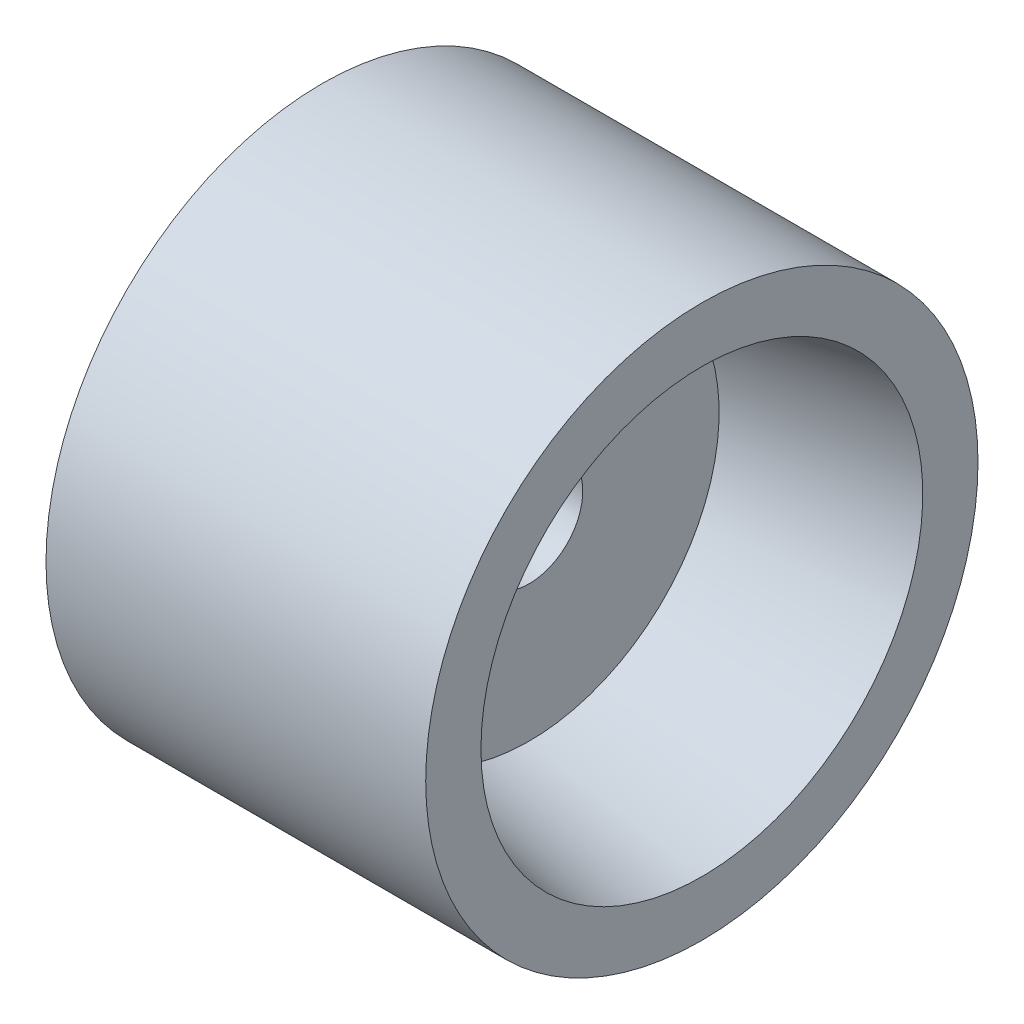
ISO-10303-21;
HEADER;
FILE_DESCRIPTION(('STEP AP214'),'2;1');
FILE_NAME('part.step','',(''),(''),'','','');
FILE_SCHEMA(('AUTOMOTIVE_DESIGN { 1 0 10303 214 1 1 1 1 }'));
ENDSEC;
DATA;
#1=APPLICATION_CONTEXT('core data for automotive mechanical design processes');
#2=APPLICATION_PROTOCOL_DEFINITION('international standard','automotive_design',2000,#1);
#3=PRODUCT_CONTEXT('',#1,'mechanical');
#4=PRODUCT('Part','Part','',(#3));
#5=PRODUCT_RELATED_PRODUCT_CATEGORY('part','',(#4));
#6=PRODUCT_DEFINITION_FORMATION('','',#4);
#7=PRODUCT_DEFINITION_CONTEXT('part definition',#1,'design');
#8=PRODUCT_DEFINITION('design','',#6,#7);
#9=PRODUCT_DEFINITION_SHAPE('','',#8);
#10=(LENGTH_UNIT() NAMED_UNIT(*) SI_UNIT(.MILLI.,.METRE.));
#11=(NAMED_UNIT(*) PLANE_ANGLE_UNIT() SI_UNIT($,.RADIAN.));
#12=(NAMED_UNIT(*) SI_UNIT($,.STERADIAN.) SOLID_ANGLE_UNIT());
#13=UNCERTAINTY_MEASURE_WITH_UNIT(LENGTH_MEASURE(1.E-05),#10,'distance_accuracy_value','');
#14=(GEOMETRIC_REPRESENTATION_CONTEXT(3) GLOBAL_UNCERTAINTY_ASSIGNED_CONTEXT((#13)) GLOBAL_UNIT_ASSIGNED_CONTEXT((#10,
#11,#12)) REPRESENTATION_CONTEXT('',''));
#15=CARTESIAN_POINT('',(0.,0.,0.));
#16=DIRECTION('',(0.,0.,1.));
#17=DIRECTION('',(1.,0.,0.));
#18=AXIS2_PLACEMENT_3D('',#15,#16,#17);
#19=CARTESIAN_POINT('',(11.,5.5,0.));
#20=DIRECTION('',(-1.,0.,0.));
#21=DIRECTION('',(0.,0.,1.));
#22=AXIS2_PLACEMENT_3D('',#19,#20,#21);
#23=PLANE('',#22);
#24=CARTESIAN_POINT('',(11.,0.,0.));
#25=DIRECTION('',(-1.,0.,0.));
#26=DIRECTION('',(0.,0.,1.));
#27=AXIS2_PLACEMENT_3D('',#24,#25,#26);
#28=CIRCLE('',#27,5.5);
#29=CARTESIAN_POINT('',(11.,0.,5.5));
#30=VERTEX_POINT('',#29);
#31=EDGE_CURVE('E80',#30,#30,#28,.T.);
#32=ORIENTED_EDGE('',*,*,#31,.F.);
#33=EDGE_LOOP('',(#32));
#34=FACE_BOUND('',#33,.T.);
#35=CARTESIAN_POINT('',(11.,0.,0.));
#36=DIRECTION('',(-1.,0.,0.));
#37=DIRECTION('',(0.,0.,1.));
#38=AXIS2_PLACEMENT_3D('',#35,#36,#37);
#39=CIRCLE('',#38,1.55);
#40=CARTESIAN_POINT('',(11.,0.,1.55));
#41=VERTEX_POINT('',#40);
#42=EDGE_CURVE('E10',#41,#41,#39,.T.);
#43=ORIENTED_EDGE('',*,*,#42,.T.);
#44=EDGE_LOOP('',(#43));
#45=FACE_BOUND('',#44,.T.);
#46=ADVANCED_FACE('F37',(#34,#45),#23,.F.);
#47=CARTESIAN_POINT('',(0.,0.,0.));
#48=DIRECTION('',(-1.,0.,0.));
#49=DIRECTION('',(0.,0.,1.));
#50=AXIS2_PLACEMENT_3D('',#47,#48,#49);
#51=CYLINDRICAL_SURFACE('',#50,1.55);
#52=ORIENTED_EDGE('',*,*,#42,.F.);
#53=EDGE_LOOP('',(#52));
#54=FACE_BOUND('',#53,.T.);
#55=CARTESIAN_POINT('',(8.,0.,0.));
#56=DIRECTION('',(-1.,0.,0.));
#57=DIRECTION('',(0.,0.,1.));
#58=AXIS2_PLACEMENT_3D('',#55,#56,#57);
#59=CIRCLE('',#58,1.55);
#60=CARTESIAN_POINT('',(8.,0.,1.55));
#61=VERTEX_POINT('',#60);
#62=EDGE_CURVE('E44',#61,#61,#59,.T.);
#63=ORIENTED_EDGE('',*,*,#62,.T.);
#64=EDGE_LOOP('',(#63));
#65=FACE_BOUND('',#64,.T.);
#66=ADVANCED_FACE('F88',(#54,#65),#51,.F.);
#67=CARTESIAN_POINT('',(8.,1.55,0.));
#68=DIRECTION('',(1.,0.,0.));
#69=DIRECTION('',(0.,0.,-1.));
#70=AXIS2_PLACEMENT_3D('',#67,#68,#69);
#71=PLANE('',#70);
#72=ORIENTED_EDGE('',*,*,#62,.F.);
#73=EDGE_LOOP('',(#72));
#74=FACE_BOUND('',#73,.T.);
#75=CARTESIAN_POINT('',(8.,0.,0.));
#76=DIRECTION('',(-1.,0.,0.));
#77=DIRECTION('',(0.,0.,1.));
#78=AXIS2_PLACEMENT_3D('',#75,#76,#77);
#79=CIRCLE('',#78,4.);
#80=CARTESIAN_POINT('',(8.,0.,4.));
#81=VERTEX_POINT('',#80);
#82=EDGE_CURVE('E49',#81,#81,#79,.T.);
#83=ORIENTED_EDGE('',*,*,#82,.T.);
#84=EDGE_LOOP('',(#83));
#85=FACE_BOUND('',#84,.T.);
#86=ADVANCED_FACE('F92',(#74,#85),#71,.F.);
#87=CARTESIAN_POINT('',(0.,0.,0.));
#88=DIRECTION('',(-1.,0.,0.));
#89=DIRECTION('',(0.,0.,1.));
#90=AXIS2_PLACEMENT_3D('',#87,#88,#89);
#91=CYLINDRICAL_SURFACE('',#90,4.);
#92=ORIENTED_EDGE('',*,*,#82,.F.);
#93=EDGE_LOOP('',(#92));
#94=FACE_BOUND('',#93,.T.);
#95=CARTESIAN_POINT('',(4.,0.,0.));
#96=DIRECTION('',(-1.,0.,0.));
#97=DIRECTION('',(0.,0.,1.));
#98=AXIS2_PLACEMENT_3D('',#95,#96,#97);
#99=CIRCLE('',#98,4.);
#100=CARTESIAN_POINT('',(4.,0.,4.));
#101=VERTEX_POINT('',#100);
#102=EDGE_CURVE('E54',#101,#101,#99,.T.);
#103=ORIENTED_EDGE('',*,*,#102,.T.);
#104=EDGE_LOOP('',(#103));
#105=FACE_BOUND('',#104,.T.);
#106=ADVANCED_FACE('F97',(#94,#105),#91,.F.);
#107=CARTESIAN_POINT('',(4.,4.,0.));
#108=DIRECTION('',(1.,0.,0.));
#109=DIRECTION('',(0.,0.,-1.));
#110=AXIS2_PLACEMENT_3D('',#107,#108,#109);
#111=PLANE('',#110);
#112=ORIENTED_EDGE('',*,*,#102,.F.);
#113=EDGE_LOOP('',(#112));
#114=FACE_BOUND('',#113,.T.);
#115=CARTESIAN_POINT('',(4.,0.,0.));
#116=DIRECTION('',(-1.,0.,0.));
#117=DIRECTION('',(0.,0.,1.));
#118=AXIS2_PLACEMENT_3D('',#115,#116,#117);
#119=CIRCLE('',#118,5.5);
#120=CARTESIAN_POINT('',(4.,0.,5.5));
#121=VERTEX_POINT('',#120);
#122=EDGE_CURVE('E60',#121,#121,#119,.T.);
#123=ORIENTED_EDGE('',*,*,#122,.T.);
#124=EDGE_LOOP('',(#123));
#125=FACE_BOUND('',#124,.T.);
#126=ADVANCED_FACE('F103',(#114,#125),#111,.F.);
#127=CARTESIAN_POINT('',(5.,0.,0.));
#128=DIRECTION('',(1.,0.,0.));
#129=DIRECTION('',(0.,0.,-1.));
#130=AXIS2_PLACEMENT_3D('',#127,#128,#129);
#131=CONICAL_SURFACE('',#130,6.4,0.732815101786507);
#132=ORIENTED_EDGE('',*,*,#122,.F.);
#133=EDGE_LOOP('',(#132));
#134=FACE_BOUND('',#133,.T.);
#135=CARTESIAN_POINT('',(5.,0.,0.));
#136=DIRECTION('',(-1.,0.,0.));
#137=DIRECTION('',(0.,0.,1.));
#138=AXIS2_PLACEMENT_3D('',#135,#136,#137);
#139=CIRCLE('',#138,6.4);
#140=CARTESIAN_POINT('',(5.,0.,6.4));
#141=VERTEX_POINT('',#140);
#142=EDGE_CURVE('E64',#141,#141,#139,.T.);
#143=ORIENTED_EDGE('',*,*,#142,.T.);
#144=EDGE_LOOP('',(#143));
#145=FACE_BOUND('',#144,.T.);
#146=ADVANCED_FACE('F107',(#134,#145),#131,.T.);
#147=CARTESIAN_POINT('',(5.,8.,0.));
#148=DIRECTION('',(1.,0.,0.));
#149=DIRECTION('',(0.,0.,-1.));
#150=AXIS2_PLACEMENT_3D('',#147,#148,#149);
#151=PLANE('',#150);
#152=ORIENTED_EDGE('',*,*,#142,.F.);
#153=EDGE_LOOP('',(#152));
#154=FACE_BOUND('',#153,.T.);
#155=CARTESIAN_POINT('',(5.,0.,0.));
#156=DIRECTION('',(-1.,0.,0.));
#157=DIRECTION('',(0.,0.,1.));
#158=AXIS2_PLACEMENT_3D('',#155,#156,#157);
#159=CIRCLE('',#158,8.);
#160=CARTESIAN_POINT('',(5.,0.,8.));
#161=VERTEX_POINT('',#160);
#162=EDGE_CURVE('E68',#161,#161,#159,.T.);
#163=ORIENTED_EDGE('',*,*,#162,.T.);
#164=EDGE_LOOP('',(#163));
#165=FACE_BOUND('',#164,.T.);
#166=ADVANCED_FACE('F111',(#154,#165),#151,.F.);
#167=CARTESIAN_POINT('',(0.,0.,0.));
#168=DIRECTION('',(-1.,0.,0.));
#169=DIRECTION('',(0.,0.,1.));
#170=AXIS2_PLACEMENT_3D('',#167,#168,#169);
#171=CYLINDRICAL_SURFACE('',#170,8.);
#172=ORIENTED_EDGE('',*,*,#162,.F.);
#173=EDGE_LOOP('',(#172));
#174=FACE_BOUND('',#173,.T.);
#175=CARTESIAN_POINT('',(16.,0.,0.));
#176=DIRECTION('',(-1.,0.,0.));
#177=DIRECTION('',(0.,0.,1.));
#178=AXIS2_PLACEMENT_3D('',#175,#176,#177);
#179=CIRCLE('',#178,8.);
#180=CARTESIAN_POINT('',(16.,0.,8.));
#181=VERTEX_POINT('',#180);
#182=EDGE_CURVE('E72',#181,#181,#179,.T.);
#183=ORIENTED_EDGE('',*,*,#182,.T.);
#184=EDGE_LOOP('',(#183));
#185=FACE_BOUND('',#184,.T.);
#186=ADVANCED_FACE('F115',(#174,#185),#171,.T.);
#187=CARTESIAN_POINT('',(16.,8.,0.));
#188=DIRECTION('',(-1.,0.,0.));
#189=DIRECTION('',(0.,0.,1.));
#190=AXIS2_PLACEMENT_3D('',#187,#188,#189);
#191=PLANE('',#190);
#192=ORIENTED_EDGE('',*,*,#182,.F.);
#193=EDGE_LOOP('',(#192));
#194=FACE_BOUND('',#193,.T.);
#195=CARTESIAN_POINT('',(16.,0.,0.));
#196=DIRECTION('',(-1.,0.,0.));
#197=DIRECTION('',(0.,0.,1.));
#198=AXIS2_PLACEMENT_3D('',#195,#196,#197);
#199=CIRCLE('',#198,6.4);
#200=CARTESIAN_POINT('',(16.,0.,6.4));
#201=VERTEX_POINT('',#200);
#202=EDGE_CURVE('E76',#201,#201,#199,.T.);
#203=ORIENTED_EDGE('',*,*,#202,.T.);
#204=EDGE_LOOP('',(#203));
#205=FACE_BOUND('',#204,.T.);
#206=ADVANCED_FACE('F119',(#194,#205),#191,.F.);
#207=CARTESIAN_POINT('',(11.,0.,0.));
#208=DIRECTION('',(1.,0.,0.));
#209=DIRECTION('',(0.,0.,-1.));
#210=AXIS2_PLACEMENT_3D('',#207,#208,#209);
#211=CONICAL_SURFACE('',#210,5.5,0.178092938231198);
#212=ORIENTED_EDGE('',*,*,#202,.F.);
#213=EDGE_LOOP('',(#212));
#214=FACE_BOUND('',#213,.T.);
#215=ORIENTED_EDGE('',*,*,#31,.T.);
#216=EDGE_LOOP('',(#215));
#217=FACE_BOUND('',#216,.T.);
#218=ADVANCED_FACE('F85',(#214,#217),#211,.F.);
#219=CLOSED_SHELL('',(#46,#66,#86,#106,#126,#146,#166,#186,#206,#218));
#220=MANIFOLD_SOLID_BREP('B2',#219);
#221=ADVANCED_BREP_SHAPE_REPRESENTATION('',(#18,#220),#14);
#222=SHAPE_DEFINITION_REPRESENTATION(#9,#221);
ENDSEC;
END-ISO-10303-21;
